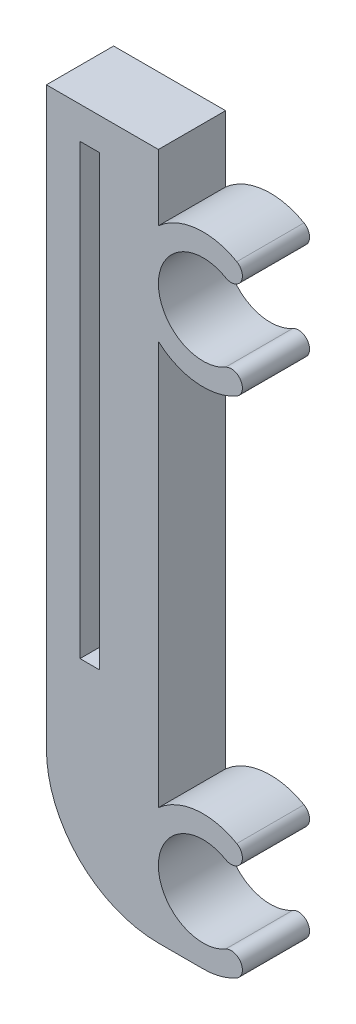
ISO-10303-21;
HEADER;
FILE_DESCRIPTION(('STEP AP214'),'2;1');
FILE_NAME('part.step','',(''),(''),'','','');
FILE_SCHEMA(('AUTOMOTIVE_DESIGN { 1 0 10303 214 1 1 1 1 }'));
ENDSEC;
DATA;
#1=APPLICATION_CONTEXT('core data for automotive mechanical design processes');
#2=APPLICATION_PROTOCOL_DEFINITION('international standard','automotive_design',2000,#1);
#3=PRODUCT_CONTEXT('',#1,'mechanical');
#4=PRODUCT('Part','Part','',(#3));
#5=PRODUCT_RELATED_PRODUCT_CATEGORY('part','',(#4));
#6=PRODUCT_DEFINITION_FORMATION('','',#4);
#7=PRODUCT_DEFINITION_CONTEXT('part definition',#1,'design');
#8=PRODUCT_DEFINITION('design','',#6,#7);
#9=PRODUCT_DEFINITION_SHAPE('','',#8);
#10=(LENGTH_UNIT() NAMED_UNIT(*) SI_UNIT(.MILLI.,.METRE.));
#11=(NAMED_UNIT(*) PLANE_ANGLE_UNIT() SI_UNIT($,.RADIAN.));
#12=(NAMED_UNIT(*) SI_UNIT($,.STERADIAN.) SOLID_ANGLE_UNIT());
#13=UNCERTAINTY_MEASURE_WITH_UNIT(LENGTH_MEASURE(1.E-05),#10,'distance_accuracy_value','');
#14=(GEOMETRIC_REPRESENTATION_CONTEXT(3) GLOBAL_UNCERTAINTY_ASSIGNED_CONTEXT((#13)) GLOBAL_UNIT_ASSIGNED_CONTEXT((#10,
#11,#12)) REPRESENTATION_CONTEXT('',''));
#15=CARTESIAN_POINT('',(0.,0.,0.));
#16=DIRECTION('',(0.,0.,1.));
#17=DIRECTION('',(1.,0.,0.));
#18=AXIS2_PLACEMENT_3D('',#15,#16,#17);
#19=CARTESIAN_POINT('',(10.0729881342838,61.375,6.));
#20=DIRECTION('',(-1.,0.,0.));
#21=DIRECTION('',(0.,0.,1.));
#22=AXIS2_PLACEMENT_3D('',#19,#20,#21);
#23=PLANE('',#22);
#24=DIRECTION('',(0.,1.,0.));
#25=VECTOR('',#24,1.);
#26=CARTESIAN_POINT('',(10.0729881342838,61.375,0.));
#27=LINE('',#26,#25);
#28=CARTESIAN_POINT('',(10.0729881342839,55.4721359549992,0.));
#29=VERTEX_POINT('',#28);
#30=CARTESIAN_POINT('',(10.0729881342838,61.375,0.));
#31=VERTEX_POINT('',#30);
#32=EDGE_CURVE('E189',#29,#31,#27,.T.);
#33=ORIENTED_EDGE('',*,*,#32,.T.);
#34=DIRECTION('',(0.,0.,-1.));
#35=VECTOR('',#34,1.);
#36=CARTESIAN_POINT('',(10.0729881342838,61.375,6.));
#37=LINE('',#36,#35);
#38=CARTESIAN_POINT('',(10.0729881342838,61.375,6.));
#39=VERTEX_POINT('',#38);
#40=EDGE_CURVE('E11',#39,#31,#37,.T.);
#41=ORIENTED_EDGE('',*,*,#40,.F.);
#42=DIRECTION('',(0.,1.,0.));
#43=VECTOR('',#42,1.);
#44=CARTESIAN_POINT('',(10.0729881342838,61.375,6.));
#45=LINE('',#44,#43);
#46=CARTESIAN_POINT('',(10.0729881342839,55.4721359549992,6.));
#47=VERTEX_POINT('',#46);
#48=EDGE_CURVE('E221',#47,#39,#45,.T.);
#49=ORIENTED_EDGE('',*,*,#48,.F.);
#50=DIRECTION('',(0.,0.,-1.));
#51=VECTOR('',#50,1.);
#52=CARTESIAN_POINT('',(10.0729881342839,55.4721359549992,6.));
#53=LINE('',#52,#51);
#54=EDGE_CURVE('E185',#47,#29,#53,.T.);
#55=ORIENTED_EDGE('',*,*,#54,.T.);
#56=EDGE_LOOP('',(#33,#41,#49,#55));
#57=FACE_BOUND('',#56,.T.);
#58=ADVANCED_FACE('F33',(#57),#23,.F.);
#59=CARTESIAN_POINT('',(10.0729881342838,61.375,6.));
#60=DIRECTION('',(0.,-1.,0.));
#61=DIRECTION('',(0.,0.,-1.));
#62=AXIS2_PLACEMENT_3D('',#59,#60,#61);
#63=PLANE('',#62);
#64=DIRECTION('',(-1.,0.,0.));
#65=VECTOR('',#64,1.);
#66=CARTESIAN_POINT('',(10.0729881342838,61.375,0.));
#67=LINE('',#66,#65);
#68=CARTESIAN_POINT('',(0.0729881342837781,61.375,0.));
#69=VERTEX_POINT('',#68);
#70=EDGE_CURVE('E192',#31,#69,#67,.T.);
#71=ORIENTED_EDGE('',*,*,#70,.T.);
#72=DIRECTION('',(0.,0.,-1.));
#73=VECTOR('',#72,1.);
#74=CARTESIAN_POINT('',(0.0729881342837781,61.375,6.));
#75=LINE('',#74,#73);
#76=CARTESIAN_POINT('',(0.0729881342837781,61.375,6.));
#77=VERTEX_POINT('',#76);
#78=EDGE_CURVE('E40',#77,#69,#75,.T.);
#79=ORIENTED_EDGE('',*,*,#78,.F.);
#80=DIRECTION('',(-1.,0.,0.));
#81=VECTOR('',#80,1.);
#82=CARTESIAN_POINT('',(10.0729881342838,61.375,6.));
#83=LINE('',#82,#81);
#84=EDGE_CURVE('E121',#39,#77,#83,.T.);
#85=ORIENTED_EDGE('',*,*,#84,.F.);
#86=ORIENTED_EDGE('',*,*,#40,.T.);
#87=EDGE_LOOP('',(#71,#79,#85,#86));
#88=FACE_BOUND('',#87,.T.);
#89=ADVANCED_FACE('F382',(#88),#63,.F.);
#90=CARTESIAN_POINT('',(0.0729881342837781,61.375,6.));
#91=DIRECTION('',(1.,0.,0.));
#92=DIRECTION('',(0.,1.,0.));
#93=AXIS2_PLACEMENT_3D('',#90,#91,#92);
#94=PLANE('',#93);
#95=DIRECTION('',(0.,-1.,0.));
#96=VECTOR('',#95,1.);
#97=CARTESIAN_POINT('',(0.0729881342837781,61.375,0.));
#98=LINE('',#97,#96);
#99=CARTESIAN_POINT('',(0.0729881342837844,10.0000000000003,0.));
#100=VERTEX_POINT('',#99);
#101=EDGE_CURVE('E195',#69,#100,#98,.T.);
#102=ORIENTED_EDGE('',*,*,#101,.T.);
#103=DIRECTION('',(0.,0.,-1.));
#104=VECTOR('',#103,1.);
#105=CARTESIAN_POINT('',(0.0729881342837844,10.0000000000003,6.));
#106=LINE('',#105,#104);
#107=CARTESIAN_POINT('',(0.0729881342837844,10.0000000000003,6.));
#108=VERTEX_POINT('',#107);
#109=EDGE_CURVE('E252',#108,#100,#106,.T.);
#110=ORIENTED_EDGE('',*,*,#109,.F.);
#111=DIRECTION('',(0.,-1.,0.));
#112=VECTOR('',#111,1.);
#113=CARTESIAN_POINT('',(0.0729881342837781,61.375,6.));
#114=LINE('',#113,#112);
#115=EDGE_CURVE('E260',#77,#108,#114,.T.);
#116=ORIENTED_EDGE('',*,*,#115,.F.);
#117=ORIENTED_EDGE('',*,*,#78,.T.);
#118=EDGE_LOOP('',(#102,#110,#116,#117));
#119=FACE_BOUND('',#118,.T.);
#120=ADVANCED_FACE('F258',(#119),#94,.F.);
#121=CARTESIAN_POINT('',(10.0729881342841,10.0000000000003,6.));
#122=DIRECTION('',(0.,0.,-1.));
#123=DIRECTION('',(-1.,0.,0.));
#124=AXIS2_PLACEMENT_3D('',#121,#122,#123);
#125=CYLINDRICAL_SURFACE('',#124,10.0000000000003);
#126=CARTESIAN_POINT('',(10.0729881342841,10.0000000000003,0.));
#127=DIRECTION('',(0.,0.,1.));
#128=DIRECTION('',(-1.,0.,0.));
#129=AXIS2_PLACEMENT_3D('',#126,#127,#128);
#130=CIRCLE('',#129,10.0000000000003);
#131=CARTESIAN_POINT('',(10.0729881342841,0.,0.));
#132=VERTEX_POINT('',#131);
#133=EDGE_CURVE('E197',#100,#132,#130,.T.);
#134=ORIENTED_EDGE('',*,*,#133,.T.);
#135=DIRECTION('',(0.,0.,-1.));
#136=VECTOR('',#135,1.);
#137=CARTESIAN_POINT('',(10.0729881342841,0.,6.));
#138=LINE('',#137,#136);
#139=CARTESIAN_POINT('',(10.0729881342841,0.,6.));
#140=VERTEX_POINT('',#139);
#141=EDGE_CURVE('E249',#140,#132,#138,.T.);
#142=ORIENTED_EDGE('',*,*,#141,.F.);
#143=CARTESIAN_POINT('',(10.0729881342841,10.0000000000003,6.));
#144=DIRECTION('',(0.,0.,1.));
#145=DIRECTION('',(-1.,0.,0.));
#146=AXIS2_PLACEMENT_3D('',#143,#144,#145);
#147=CIRCLE('',#146,10.0000000000003);
#148=EDGE_CURVE('E278',#108,#140,#147,.T.);
#149=ORIENTED_EDGE('',*,*,#148,.F.);
#150=ORIENTED_EDGE('',*,*,#109,.T.);
#151=EDGE_LOOP('',(#134,#142,#149,#150));
#152=FACE_BOUND('',#151,.T.);
#153=ADVANCED_FACE('F269',(#152),#125,.T.);
#154=CARTESIAN_POINT('',(14.0729881342842,0.,6.));
#155=DIRECTION('',(0.,1.,0.));
#156=DIRECTION('',(-1.,0.,0.));
#157=AXIS2_PLACEMENT_3D('',#154,#155,#156);
#158=PLANE('',#157);
#159=DIRECTION('',(1.,0.,0.));
#160=VECTOR('',#159,1.);
#161=CARTESIAN_POINT('',(14.0729881342842,0.,0.));
#162=LINE('',#161,#160);
#163=CARTESIAN_POINT('',(14.0729881342842,0.,0.));
#164=VERTEX_POINT('',#163);
#165=EDGE_CURVE('E199',#132,#164,#162,.T.);
#166=ORIENTED_EDGE('',*,*,#165,.T.);
#167=DIRECTION('',(0.,0.,-1.));
#168=VECTOR('',#167,1.);
#169=CARTESIAN_POINT('',(14.0729881342842,0.,6.));
#170=LINE('',#169,#168);
#171=CARTESIAN_POINT('',(14.0729881342842,0.,6.));
#172=VERTEX_POINT('',#171);
#173=EDGE_CURVE('E246',#172,#164,#170,.T.);
#174=ORIENTED_EDGE('',*,*,#173,.F.);
#175=DIRECTION('',(1.,0.,0.));
#176=VECTOR('',#175,1.);
#177=CARTESIAN_POINT('',(14.0729881342842,0.,6.));
#178=LINE('',#177,#176);
#179=EDGE_CURVE('E275',#140,#172,#178,.T.);
#180=ORIENTED_EDGE('',*,*,#179,.F.);
#181=ORIENTED_EDGE('',*,*,#141,.T.);
#182=EDGE_LOOP('',(#166,#174,#180,#181));
#183=FACE_BOUND('',#182,.T.);
#184=ADVANCED_FACE('F273',(#183),#158,.F.);
#185=CARTESIAN_POINT('',(14.0729881342842,5.99999999999987,6.));
#186=DIRECTION('',(0.,0.,-1.));
#187=DIRECTION('',(-1.,0.,0.));
#188=AXIS2_PLACEMENT_3D('',#185,#186,#187);
#189=CYLINDRICAL_SURFACE('',#188,5.99999999999987);
#190=CARTESIAN_POINT('',(14.0729881342842,5.99999999999987,0.));
#191=DIRECTION('',(0.,0.,1.));
#192=DIRECTION('',(1.,0.,0.));
#193=AXIS2_PLACEMENT_3D('',#190,#191,#192);
#194=CIRCLE('',#193,5.99999999999987);
#195=CARTESIAN_POINT('',(17.0729881342842,0.803847577293373,0.));
#196=VERTEX_POINT('',#195);
#197=EDGE_CURVE('E201',#164,#196,#194,.T.);
#198=ORIENTED_EDGE('',*,*,#197,.T.);
#199=DIRECTION('',(0.,0.,-1.));
#200=VECTOR('',#199,1.);
#201=CARTESIAN_POINT('',(17.0729881342842,0.803847577293373,6.));
#202=LINE('',#201,#200);
#203=CARTESIAN_POINT('',(17.0729881342842,0.803847577293373,6.));
#204=VERTEX_POINT('',#203);
#205=EDGE_CURVE('E243',#204,#196,#202,.T.);
#206=ORIENTED_EDGE('',*,*,#205,.F.);
#207=CARTESIAN_POINT('',(14.0729881342842,5.99999999999987,6.));
#208=DIRECTION('',(0.,0.,1.));
#209=DIRECTION('',(1.,0.,0.));
#210=AXIS2_PLACEMENT_3D('',#207,#208,#209);
#211=CIRCLE('',#210,5.99999999999987);
#212=EDGE_CURVE('E277',#172,#204,#211,.T.);
#213=ORIENTED_EDGE('',*,*,#212,.F.);
#214=ORIENTED_EDGE('',*,*,#173,.T.);
#215=EDGE_LOOP('',(#198,#206,#213,#214));
#216=FACE_BOUND('',#215,.T.);
#217=ADVANCED_FACE('F395',(#216),#189,.T.);
#218=CARTESIAN_POINT('',(16.5729881342842,1.6698729810777,6.));
#219=DIRECTION('',(0.,0.,-1.));
#220=DIRECTION('',(-1.,0.,0.));
#221=AXIS2_PLACEMENT_3D('',#218,#219,#220);
#222=CYLINDRICAL_SURFACE('',#221,0.999999999999879);
#223=CARTESIAN_POINT('',(16.5729881342842,1.6698729810777,0.));
#224=DIRECTION('',(0.,0.,1.));
#225=DIRECTION('',(1.,0.,0.));
#226=AXIS2_PLACEMENT_3D('',#223,#224,#225);
#227=CIRCLE('',#226,0.999999999999879);
#228=CARTESIAN_POINT('',(16.0729881342843,2.53589838486206,0.));
#229=VERTEX_POINT('',#228);
#230=EDGE_CURVE('E203',#196,#229,#227,.T.);
#231=ORIENTED_EDGE('',*,*,#230,.T.);
#232=DIRECTION('',(0.,0.,-1.));
#233=VECTOR('',#232,1.);
#234=CARTESIAN_POINT('',(16.0729881342843,2.53589838486206,6.));
#235=LINE('',#234,#233);
#236=CARTESIAN_POINT('',(16.0729881342843,2.53589838486206,6.));
#237=VERTEX_POINT('',#236);
#238=EDGE_CURVE('E240',#237,#229,#235,.T.);
#239=ORIENTED_EDGE('',*,*,#238,.F.);
#240=CARTESIAN_POINT('',(16.5729881342842,1.6698729810777,6.));
#241=DIRECTION('',(0.,0.,1.));
#242=DIRECTION('',(1.,0.,0.));
#243=AXIS2_PLACEMENT_3D('',#240,#241,#242);
#244=CIRCLE('',#243,0.999999999999879);
#245=EDGE_CURVE('E280',#204,#237,#244,.T.);
#246=ORIENTED_EDGE('',*,*,#245,.F.);
#247=ORIENTED_EDGE('',*,*,#205,.T.);
#248=EDGE_LOOP('',(#231,#239,#246,#247));
#249=FACE_BOUND('',#248,.T.);
#250=ADVANCED_FACE('F398',(#249),#222,.T.);
#251=CARTESIAN_POINT('',(14.0729881342842,5.99999999999987,6.));
#252=DIRECTION('',(0.,0.,-1.));
#253=DIRECTION('',(-1.,0.,0.));
#254=AXIS2_PLACEMENT_3D('',#251,#252,#253);
#255=CYLINDRICAL_SURFACE('',#254,4.00000000000011);
#256=CARTESIAN_POINT('',(14.0729881342842,5.99999999999987,0.));
#257=DIRECTION('',(0.,0.,-1.));
#258=DIRECTION('',(1.,0.,0.));
#259=AXIS2_PLACEMENT_3D('',#256,#257,#258);
#260=CIRCLE('',#259,4.00000000000011);
#261=CARTESIAN_POINT('',(16.0729881342842,9.46410161513774,0.));
#262=VERTEX_POINT('',#261);
#263=EDGE_CURVE('E205',#229,#262,#260,.T.);
#264=ORIENTED_EDGE('',*,*,#263,.T.);
#265=DIRECTION('',(0.,0.,-1.));
#266=VECTOR('',#265,1.);
#267=CARTESIAN_POINT('',(16.0729881342842,9.46410161513774,6.));
#268=LINE('',#267,#266);
#269=CARTESIAN_POINT('',(16.0729881342842,9.46410161513774,6.));
#270=VERTEX_POINT('',#269);
#271=EDGE_CURVE('E237',#270,#262,#268,.T.);
#272=ORIENTED_EDGE('',*,*,#271,.F.);
#273=CARTESIAN_POINT('',(14.0729881342842,5.99999999999987,6.));
#274=DIRECTION('',(0.,0.,-1.));
#275=DIRECTION('',(1.,0.,0.));
#276=AXIS2_PLACEMENT_3D('',#273,#274,#275);
#277=CIRCLE('',#276,4.00000000000011);
#278=EDGE_CURVE('E286',#237,#270,#277,.T.);
#279=ORIENTED_EDGE('',*,*,#278,.F.);
#280=ORIENTED_EDGE('',*,*,#238,.T.);
#281=EDGE_LOOP('',(#264,#272,#279,#280));
#282=FACE_BOUND('',#281,.T.);
#283=ADVANCED_FACE('F402',(#282),#255,.F.);
#284=CARTESIAN_POINT('',(16.5729881342841,10.3301270189221,6.));
#285=DIRECTION('',(0.,0.,-1.));
#286=DIRECTION('',(-1.,0.,0.));
#287=AXIS2_PLACEMENT_3D('',#284,#285,#286);
#288=CYLINDRICAL_SURFACE('',#287,0.999999999999879);
#289=CARTESIAN_POINT('',(16.5729881342841,10.3301270189221,0.));
#290=DIRECTION('',(0.,0.,1.));
#291=DIRECTION('',(1.,0.,0.));
#292=AXIS2_PLACEMENT_3D('',#289,#290,#291);
#293=CIRCLE('',#292,0.999999999999879);
#294=CARTESIAN_POINT('',(17.0729881342841,11.1961524227064,0.));
#295=VERTEX_POINT('',#294);
#296=EDGE_CURVE('E207',#262,#295,#293,.T.);
#297=ORIENTED_EDGE('',*,*,#296,.T.);
#298=DIRECTION('',(0.,0.,-1.));
#299=VECTOR('',#298,1.);
#300=CARTESIAN_POINT('',(17.0729881342841,11.1961524227064,6.));
#301=LINE('',#300,#299);
#302=CARTESIAN_POINT('',(17.0729881342841,11.1961524227064,6.));
#303=VERTEX_POINT('',#302);
#304=EDGE_CURVE('E234',#303,#295,#301,.T.);
#305=ORIENTED_EDGE('',*,*,#304,.F.);
#306=CARTESIAN_POINT('',(16.5729881342841,10.3301270189221,6.));
#307=DIRECTION('',(0.,0.,1.));
#308=DIRECTION('',(1.,0.,0.));
#309=AXIS2_PLACEMENT_3D('',#306,#307,#308);
#310=CIRCLE('',#309,0.999999999999879);
#311=EDGE_CURVE('E288',#270,#303,#310,.T.);
#312=ORIENTED_EDGE('',*,*,#311,.F.);
#313=ORIENTED_EDGE('',*,*,#271,.T.);
#314=EDGE_LOOP('',(#297,#305,#312,#313));
#315=FACE_BOUND('',#314,.T.);
#316=ADVANCED_FACE('F406',(#315),#288,.T.);
#317=CARTESIAN_POINT('',(14.0729881342842,5.99999999999987,6.));
#318=DIRECTION('',(0.,0.,-1.));
#319=DIRECTION('',(-1.,0.,0.));
#320=AXIS2_PLACEMENT_3D('',#317,#318,#319);
#321=CYLINDRICAL_SURFACE('',#320,5.99999999999986);
#322=CARTESIAN_POINT('',(14.0729881342842,5.99999999999987,0.));
#323=DIRECTION('',(0.,0.,1.));
#324=DIRECTION('',(1.,0.,0.));
#325=AXIS2_PLACEMENT_3D('',#322,#323,#324);
#326=CIRCLE('',#325,5.99999999999986);
#327=CARTESIAN_POINT('',(10.0729881342841,10.4721359549992,0.));
#328=VERTEX_POINT('',#327);
#329=EDGE_CURVE('E209',#295,#328,#326,.T.);
#330=ORIENTED_EDGE('',*,*,#329,.T.);
#331=DIRECTION('',(0.,0.,-1.));
#332=VECTOR('',#331,1.);
#333=CARTESIAN_POINT('',(10.0729881342841,10.4721359549992,6.));
#334=LINE('',#333,#332);
#335=CARTESIAN_POINT('',(10.0729881342841,10.4721359549992,6.));
#336=VERTEX_POINT('',#335);
#337=EDGE_CURVE('E231',#336,#328,#334,.T.);
#338=ORIENTED_EDGE('',*,*,#337,.F.);
#339=CARTESIAN_POINT('',(14.0729881342842,5.99999999999987,6.));
#340=DIRECTION('',(0.,0.,1.));
#341=DIRECTION('',(1.,0.,0.));
#342=AXIS2_PLACEMENT_3D('',#339,#340,#341);
#343=CIRCLE('',#342,5.99999999999986);
#344=EDGE_CURVE('E290',#303,#336,#343,.T.);
#345=ORIENTED_EDGE('',*,*,#344,.F.);
#346=ORIENTED_EDGE('',*,*,#304,.T.);
#347=EDGE_LOOP('',(#330,#338,#345,#346));
#348=FACE_BOUND('',#347,.T.);
#349=ADVANCED_FACE('F410',(#348),#321,.T.);
#350=CARTESIAN_POINT('',(10.0729881342841,10.4721359549992,6.));
#351=DIRECTION('',(-1.,0.,0.));
#352=DIRECTION('',(0.,0.,1.));
#353=AXIS2_PLACEMENT_3D('',#350,#351,#352);
#354=PLANE('',#353);
#355=DIRECTION('',(0.,1.,0.));
#356=VECTOR('',#355,1.);
#357=CARTESIAN_POINT('',(10.0729881342841,10.4721359549992,0.));
#358=LINE('',#357,#356);
#359=CARTESIAN_POINT('',(10.0729881342841,46.5278640450004,0.));
#360=VERTEX_POINT('',#359);
#361=EDGE_CURVE('E211',#328,#360,#358,.T.);
#362=ORIENTED_EDGE('',*,*,#361,.T.);
#363=DIRECTION('',(0.,0.,-1.));
#364=VECTOR('',#363,1.);
#365=CARTESIAN_POINT('',(10.0729881342841,46.5278640450004,6.));
#366=LINE('',#365,#364);
#367=CARTESIAN_POINT('',(10.0729881342841,46.5278640450004,6.));
#368=VERTEX_POINT('',#367);
#369=EDGE_CURVE('E228',#368,#360,#366,.T.);
#370=ORIENTED_EDGE('',*,*,#369,.F.);
#371=DIRECTION('',(0.,1.,0.));
#372=VECTOR('',#371,1.);
#373=CARTESIAN_POINT('',(10.0729881342841,10.4721359549992,6.));
#374=LINE('',#373,#372);
#375=EDGE_CURVE('E292',#336,#368,#374,.T.);
#376=ORIENTED_EDGE('',*,*,#375,.F.);
#377=ORIENTED_EDGE('',*,*,#337,.T.);
#378=EDGE_LOOP('',(#362,#370,#376,#377));
#379=FACE_BOUND('',#378,.T.);
#380=ADVANCED_FACE('F414',(#379),#354,.F.);
#381=CARTESIAN_POINT('',(14.0729881342826,51.,6.));
#382=DIRECTION('',(0.,0.,-1.));
#383=DIRECTION('',(-1.,0.,0.));
#384=AXIS2_PLACEMENT_3D('',#381,#382,#383);
#385=CYLINDRICAL_SURFACE('',#384,5.99999999999902);
#386=CARTESIAN_POINT('',(14.0729881342826,51.,0.));
#387=DIRECTION('',(0.,0.,1.));
#388=DIRECTION('',(1.,0.,0.));
#389=AXIS2_PLACEMENT_3D('',#386,#387,#388);
#390=CIRCLE('',#389,5.99999999999902);
#391=CARTESIAN_POINT('',(17.0729881342831,45.8038475772948,0.));
#392=VERTEX_POINT('',#391);
#393=EDGE_CURVE('E213',#360,#392,#390,.T.);
#394=ORIENTED_EDGE('',*,*,#393,.T.);
#395=DIRECTION('',(0.,0.,-1.));
#396=VECTOR('',#395,1.);
#397=CARTESIAN_POINT('',(17.0729881342831,45.8038475772948,6.));
#398=LINE('',#397,#396);
#399=CARTESIAN_POINT('',(17.0729881342831,45.8038475772948,6.));
#400=VERTEX_POINT('',#399);
#401=EDGE_CURVE('E225',#400,#392,#398,.T.);
#402=ORIENTED_EDGE('',*,*,#401,.F.);
#403=CARTESIAN_POINT('',(14.0729881342826,51.,6.));
#404=DIRECTION('',(0.,0.,1.));
#405=DIRECTION('',(1.,0.,0.));
#406=AXIS2_PLACEMENT_3D('',#403,#404,#405);
#407=CIRCLE('',#406,5.99999999999902);
#408=EDGE_CURVE('E294',#368,#400,#407,.T.);
#409=ORIENTED_EDGE('',*,*,#408,.F.);
#410=ORIENTED_EDGE('',*,*,#369,.T.);
#411=EDGE_LOOP('',(#394,#402,#409,#410));
#412=FACE_BOUND('',#411,.T.);
#413=ADVANCED_FACE('F300',(#412),#385,.T.);
#414=CARTESIAN_POINT('',(16.5729881342835,46.6698729810784,6.));
#415=DIRECTION('',(0.,0.,-1.));
#416=DIRECTION('',(-1.,0.,0.));
#417=AXIS2_PLACEMENT_3D('',#414,#415,#416);
#418=CYLINDRICAL_SURFACE('',#417,0.999999999998944);
#419=CARTESIAN_POINT('',(16.5729881342835,46.6698729810784,0.));
#420=DIRECTION('',(0.,0.,1.));
#421=DIRECTION('',(1.,0.,0.));
#422=AXIS2_PLACEMENT_3D('',#419,#420,#421);
#423=CIRCLE('',#422,0.999999999998944);
#424=CARTESIAN_POINT('',(16.072988134284,47.5358983848619,0.));
#425=VERTEX_POINT('',#424);
#426=EDGE_CURVE('E215',#392,#425,#423,.T.);
#427=ORIENTED_EDGE('',*,*,#426,.T.);
#428=DIRECTION('',(0.,0.,-1.));
#429=VECTOR('',#428,1.);
#430=CARTESIAN_POINT('',(16.072988134284,47.5358983848619,6.));
#431=LINE('',#430,#429);
#432=CARTESIAN_POINT('',(16.072988134284,47.5358983848619,6.));
#433=VERTEX_POINT('',#432);
#434=EDGE_CURVE('E180',#433,#425,#431,.T.);
#435=ORIENTED_EDGE('',*,*,#434,.F.);
#436=CARTESIAN_POINT('',(16.5729881342835,46.6698729810784,6.));
#437=DIRECTION('',(0.,0.,1.));
#438=DIRECTION('',(1.,0.,0.));
#439=AXIS2_PLACEMENT_3D('',#436,#437,#438);
#440=CIRCLE('',#439,0.999999999998944);
#441=EDGE_CURVE('E168',#400,#433,#440,.T.);
#442=ORIENTED_EDGE('',*,*,#441,.F.);
#443=ORIENTED_EDGE('',*,*,#401,.T.);
#444=EDGE_LOOP('',(#427,#435,#442,#443));
#445=FACE_BOUND('',#444,.T.);
#446=ADVANCED_FACE('F304',(#445),#418,.T.);
#447=CARTESIAN_POINT('',(14.0729881342826,51.,6.));
#448=DIRECTION('',(0.,0.,-1.));
#449=DIRECTION('',(-1.,0.,0.));
#450=AXIS2_PLACEMENT_3D('',#447,#448,#449);
#451=CYLINDRICAL_SURFACE('',#450,4.00000000000094);
#452=CARTESIAN_POINT('',(14.0729881342826,51.,0.));
#453=DIRECTION('',(0.,0.,-1.));
#454=DIRECTION('',(1.,0.,0.));
#455=AXIS2_PLACEMENT_3D('',#452,#453,#454);
#456=CIRCLE('',#455,4.00000000000094);
#457=CARTESIAN_POINT('',(16.0729881342843,54.4641016151379,0.));
#458=VERTEX_POINT('',#457);
#459=EDGE_CURVE('E177',#425,#458,#456,.T.);
#460=ORIENTED_EDGE('',*,*,#459,.T.);
#461=DIRECTION('',(0.,0.,-1.));
#462=VECTOR('',#461,1.);
#463=CARTESIAN_POINT('',(16.0729881342843,54.4641016151379,6.));
#464=LINE('',#463,#462);
#465=CARTESIAN_POINT('',(16.0729881342843,54.4641016151379,6.));
#466=VERTEX_POINT('',#465);
#467=EDGE_CURVE('E174',#466,#458,#464,.T.);
#468=ORIENTED_EDGE('',*,*,#467,.F.);
#469=CARTESIAN_POINT('',(14.0729881342826,51.,6.));
#470=DIRECTION('',(0.,0.,-1.));
#471=DIRECTION('',(1.,0.,0.));
#472=AXIS2_PLACEMENT_3D('',#469,#470,#471);
#473=CIRCLE('',#472,4.00000000000094);
#474=EDGE_CURVE('E161',#433,#466,#473,.T.);
#475=ORIENTED_EDGE('',*,*,#474,.F.);
#476=ORIENTED_EDGE('',*,*,#434,.T.);
#477=EDGE_LOOP('',(#460,#468,#475,#476));
#478=FACE_BOUND('',#477,.T.);
#479=ADVANCED_FACE('F175',(#478),#451,.F.);
#480=CARTESIAN_POINT('',(16.5729881342838,55.3301270189211,6.));
#481=DIRECTION('',(0.,0.,-1.));
#482=DIRECTION('',(-1.,0.,0.));
#483=AXIS2_PLACEMENT_3D('',#480,#481,#482);
#484=CYLINDRICAL_SURFACE('',#483,0.999999999998991);
#485=CARTESIAN_POINT('',(16.5729881342838,55.3301270189211,0.));
#486=DIRECTION('',(0.,0.,1.));
#487=DIRECTION('',(1.,0.,0.));
#488=AXIS2_PLACEMENT_3D('',#485,#486,#487);
#489=CIRCLE('',#488,0.999999999998991);
#490=CARTESIAN_POINT('',(17.0729881342834,56.1961524227046,0.));
#491=VERTEX_POINT('',#490);
#492=EDGE_CURVE('E218',#458,#491,#489,.T.);
#493=ORIENTED_EDGE('',*,*,#492,.T.);
#494=DIRECTION('',(0.,0.,-1.));
#495=VECTOR('',#494,1.);
#496=CARTESIAN_POINT('',(17.0729881342834,56.1961524227046,6.));
#497=LINE('',#496,#495);
#498=CARTESIAN_POINT('',(17.0729881342834,56.1961524227046,6.));
#499=VERTEX_POINT('',#498);
#500=EDGE_CURVE('E181',#499,#491,#497,.T.);
#501=ORIENTED_EDGE('',*,*,#500,.F.);
#502=CARTESIAN_POINT('',(16.5729881342838,55.3301270189211,6.));
#503=DIRECTION('',(0.,0.,1.));
#504=DIRECTION('',(1.,0.,0.));
#505=AXIS2_PLACEMENT_3D('',#502,#503,#504);
#506=CIRCLE('',#505,0.999999999998991);
#507=EDGE_CURVE('E165',#466,#499,#506,.T.);
#508=ORIENTED_EDGE('',*,*,#507,.F.);
#509=ORIENTED_EDGE('',*,*,#467,.T.);
#510=EDGE_LOOP('',(#493,#501,#508,#509));
#511=FACE_BOUND('',#510,.T.);
#512=ADVANCED_FACE('F183',(#511),#484,.T.);
#513=CARTESIAN_POINT('',(14.0729881342826,51.,6.));
#514=DIRECTION('',(0.,0.,-1.));
#515=DIRECTION('',(-1.,0.,0.));
#516=AXIS2_PLACEMENT_3D('',#513,#514,#515);
#517=CYLINDRICAL_SURFACE('',#516,5.99999999999887);
#518=CARTESIAN_POINT('',(14.0729881342826,51.,0.));
#519=DIRECTION('',(0.,0.,1.));
#520=DIRECTION('',(1.,0.,0.));
#521=AXIS2_PLACEMENT_3D('',#518,#519,#520);
#522=CIRCLE('',#521,5.99999999999887);
#523=EDGE_CURVE('E113',#491,#29,#522,.T.);
#524=ORIENTED_EDGE('',*,*,#523,.T.);
#525=ORIENTED_EDGE('',*,*,#54,.F.);
#526=CARTESIAN_POINT('',(14.0729881342826,51.,6.));
#527=DIRECTION('',(0.,0.,1.));
#528=DIRECTION('',(1.,0.,0.));
#529=AXIS2_PLACEMENT_3D('',#526,#527,#528);
#530=CIRCLE('',#529,5.99999999999887);
#531=EDGE_CURVE('E56',#499,#47,#530,.T.);
#532=ORIENTED_EDGE('',*,*,#531,.F.);
#533=ORIENTED_EDGE('',*,*,#500,.T.);
#534=EDGE_LOOP('',(#524,#525,#532,#533));
#535=FACE_BOUND('',#534,.T.);
#536=ADVANCED_FACE('F305',(#535),#517,.T.);
#537=CARTESIAN_POINT('',(14.0729881342826,51.,6.));
#538=DIRECTION('',(0.,0.,1.));
#539=DIRECTION('',(1.,0.,0.));
#540=AXIS2_PLACEMENT_3D('',#537,#538,#539);
#541=PLANE('',#540);
#542=DIRECTION('',(0.,-1.,0.));
#543=VECTOR('',#542,1.);
#544=CARTESIAN_POINT('',(3.07298813428378,58.5,6.));
#545=LINE('',#544,#543);
#546=CARTESIAN_POINT('',(3.07298813428378,58.5,6.));
#547=VERTEX_POINT('',#546);
#548=CARTESIAN_POINT('',(3.07298813428378,18.5,6.));
#549=VERTEX_POINT('',#548);
#550=EDGE_CURVE('E47',#547,#549,#545,.T.);
#551=ORIENTED_EDGE('',*,*,#550,.F.);
#552=DIRECTION('',(-1.,0.,0.));
#553=VECTOR('',#552,1.);
#554=CARTESIAN_POINT('',(3.07298813428378,58.5,6.));
#555=LINE('',#554,#553);
#556=CARTESIAN_POINT('',(4.82298813428378,58.5,6.));
#557=VERTEX_POINT('',#556);
#558=EDGE_CURVE('E322',#557,#547,#555,.T.);
#559=ORIENTED_EDGE('',*,*,#558,.F.);
#560=DIRECTION('',(0.,1.,0.));
#561=VECTOR('',#560,1.);
#562=CARTESIAN_POINT('',(4.82298813428378,58.5,6.));
#563=LINE('',#562,#561);
#564=CARTESIAN_POINT('',(4.82298813428378,18.5,6.));
#565=VERTEX_POINT('',#564);
#566=EDGE_CURVE('E326',#565,#557,#563,.T.);
#567=ORIENTED_EDGE('',*,*,#566,.F.);
#568=DIRECTION('',(1.,0.,0.));
#569=VECTOR('',#568,1.);
#570=CARTESIAN_POINT('',(3.07298813428378,18.5,6.));
#571=LINE('',#570,#569);
#572=EDGE_CURVE('E329',#549,#565,#571,.T.);
#573=ORIENTED_EDGE('',*,*,#572,.F.);
#574=EDGE_LOOP('',(#551,#559,#567,#573));
#575=FACE_BOUND('',#574,.T.);
#576=ORIENTED_EDGE('',*,*,#48,.T.);
#577=ORIENTED_EDGE('',*,*,#84,.T.);
#578=ORIENTED_EDGE('',*,*,#115,.T.);
#579=ORIENTED_EDGE('',*,*,#148,.T.);
#580=ORIENTED_EDGE('',*,*,#179,.T.);
#581=ORIENTED_EDGE('',*,*,#212,.T.);
#582=ORIENTED_EDGE('',*,*,#245,.T.);
#583=ORIENTED_EDGE('',*,*,#278,.T.);
#584=ORIENTED_EDGE('',*,*,#311,.T.);
#585=ORIENTED_EDGE('',*,*,#344,.T.);
#586=ORIENTED_EDGE('',*,*,#375,.T.);
#587=ORIENTED_EDGE('',*,*,#408,.T.);
#588=ORIENTED_EDGE('',*,*,#441,.T.);
#589=ORIENTED_EDGE('',*,*,#474,.T.);
#590=ORIENTED_EDGE('',*,*,#507,.T.);
#591=ORIENTED_EDGE('',*,*,#531,.T.);
#592=EDGE_LOOP('',(#576,#577,#578,#579,#580,#581,#582,#583,#584,#585,#586,#587,#588,#589,#590,#591));
#593=FACE_BOUND('',#592,.T.);
#594=ADVANCED_FACE('F163',(#575,#593),#541,.T.);
#595=CARTESIAN_POINT('',(14.0729881342826,51.,0.));
#596=DIRECTION('',(0.,0.,1.));
#597=DIRECTION('',(1.,0.,0.));
#598=AXIS2_PLACEMENT_3D('',#595,#596,#597);
#599=PLANE('',#598);
#600=ORIENTED_EDGE('',*,*,#32,.F.);
#601=ORIENTED_EDGE('',*,*,#523,.F.);
#602=ORIENTED_EDGE('',*,*,#492,.F.);
#603=ORIENTED_EDGE('',*,*,#459,.F.);
#604=ORIENTED_EDGE('',*,*,#426,.F.);
#605=ORIENTED_EDGE('',*,*,#393,.F.);
#606=ORIENTED_EDGE('',*,*,#361,.F.);
#607=ORIENTED_EDGE('',*,*,#329,.F.);
#608=ORIENTED_EDGE('',*,*,#296,.F.);
#609=ORIENTED_EDGE('',*,*,#263,.F.);
#610=ORIENTED_EDGE('',*,*,#230,.F.);
#611=ORIENTED_EDGE('',*,*,#197,.F.);
#612=ORIENTED_EDGE('',*,*,#165,.F.);
#613=ORIENTED_EDGE('',*,*,#133,.F.);
#614=ORIENTED_EDGE('',*,*,#101,.F.);
#615=ORIENTED_EDGE('',*,*,#70,.F.);
#616=EDGE_LOOP('',(#600,#601,#602,#603,#604,#605,#606,#607,#608,#609,#610,#611,#612,#613,#614,#615));
#617=FACE_BOUND('',#616,.T.);
#618=ADVANCED_FACE('F264',(#617),#599,.F.);
#619=CARTESIAN_POINT('',(3.07298813428378,58.5,1.5));
#620=DIRECTION('',(-1.,0.,0.));
#621=DIRECTION('',(0.,-1.,0.));
#622=AXIS2_PLACEMENT_3D('',#619,#620,#621);
#623=PLANE('',#622);
#624=ORIENTED_EDGE('',*,*,#550,.T.);
#625=DIRECTION('',(0.,0.,1.));
#626=VECTOR('',#625,1.);
#627=CARTESIAN_POINT('',(3.07298813428378,18.5,1.5));
#628=LINE('',#627,#626);
#629=CARTESIAN_POINT('',(3.07298813428378,18.5,1.5));
#630=VERTEX_POINT('',#629);
#631=EDGE_CURVE('E312',#630,#549,#628,.T.);
#632=ORIENTED_EDGE('',*,*,#631,.F.);
#633=DIRECTION('',(0.,-1.,0.));
#634=VECTOR('',#633,1.);
#635=CARTESIAN_POINT('',(3.07298813428378,58.5,1.5));
#636=LINE('',#635,#634);
#637=CARTESIAN_POINT('',(3.07298813428378,58.5,1.5));
#638=VERTEX_POINT('',#637);
#639=EDGE_CURVE('E325',#638,#630,#636,.T.);
#640=ORIENTED_EDGE('',*,*,#639,.F.);
#641=DIRECTION('',(0.,0.,1.));
#642=VECTOR('',#641,1.);
#643=CARTESIAN_POINT('',(3.07298813428378,58.5,1.5));
#644=LINE('',#643,#642);
#645=EDGE_CURVE('E193',#638,#547,#644,.T.);
#646=ORIENTED_EDGE('',*,*,#645,.T.);
#647=EDGE_LOOP('',(#624,#632,#640,#646));
#648=FACE_BOUND('',#647,.T.);
#649=ADVANCED_FACE('F350',(#648),#623,.F.);
#650=CARTESIAN_POINT('',(3.07298813428378,58.5,1.5));
#651=DIRECTION('',(0.,1.,0.));
#652=DIRECTION('',(0.,0.,1.));
#653=AXIS2_PLACEMENT_3D('',#650,#651,#652);
#654=PLANE('',#653);
#655=ORIENTED_EDGE('',*,*,#558,.T.);
#656=ORIENTED_EDGE('',*,*,#645,.F.);
#657=DIRECTION('',(-1.,0.,0.));
#658=VECTOR('',#657,1.);
#659=CARTESIAN_POINT('',(3.07298813428378,58.5,1.5));
#660=LINE('',#659,#658);
#661=CARTESIAN_POINT('',(4.82298813428378,58.5,1.5));
#662=VERTEX_POINT('',#661);
#663=EDGE_CURVE('E315',#662,#638,#660,.T.);
#664=ORIENTED_EDGE('',*,*,#663,.F.);
#665=DIRECTION('',(0.,0.,1.));
#666=VECTOR('',#665,1.);
#667=CARTESIAN_POINT('',(4.82298813428378,58.5,1.5));
#668=LINE('',#667,#666);
#669=EDGE_CURVE('E318',#662,#557,#668,.T.);
#670=ORIENTED_EDGE('',*,*,#669,.T.);
#671=EDGE_LOOP('',(#655,#656,#664,#670));
#672=FACE_BOUND('',#671,.T.);
#673=ADVANCED_FACE('F361',(#672),#654,.F.);
#674=CARTESIAN_POINT('',(4.82298813428378,58.5,1.5));
#675=DIRECTION('',(1.,0.,0.));
#676=DIRECTION('',(0.,1.,0.));
#677=AXIS2_PLACEMENT_3D('',#674,#675,#676);
#678=PLANE('',#677);
#679=ORIENTED_EDGE('',*,*,#566,.T.);
#680=ORIENTED_EDGE('',*,*,#669,.F.);
#681=DIRECTION('',(0.,1.,0.));
#682=VECTOR('',#681,1.);
#683=CARTESIAN_POINT('',(4.82298813428378,58.5,1.5));
#684=LINE('',#683,#682);
#685=CARTESIAN_POINT('',(4.82298813428378,18.5,1.5));
#686=VERTEX_POINT('',#685);
#687=EDGE_CURVE('E335',#686,#662,#684,.T.);
#688=ORIENTED_EDGE('',*,*,#687,.F.);
#689=DIRECTION('',(0.,0.,1.));
#690=VECTOR('',#689,1.);
#691=CARTESIAN_POINT('',(4.82298813428378,18.5,1.5));
#692=LINE('',#691,#690);
#693=EDGE_CURVE('E314',#686,#565,#692,.T.);
#694=ORIENTED_EDGE('',*,*,#693,.T.);
#695=EDGE_LOOP('',(#679,#680,#688,#694));
#696=FACE_BOUND('',#695,.T.);
#697=ADVANCED_FACE('F366',(#696),#678,.F.);
#698=CARTESIAN_POINT('',(3.07298813428378,18.5,1.5));
#699=DIRECTION('',(0.,-1.,0.));
#700=DIRECTION('',(0.,0.,-1.));
#701=AXIS2_PLACEMENT_3D('',#698,#699,#700);
#702=PLANE('',#701);
#703=ORIENTED_EDGE('',*,*,#572,.T.);
#704=ORIENTED_EDGE('',*,*,#693,.F.);
#705=DIRECTION('',(1.,0.,0.));
#706=VECTOR('',#705,1.);
#707=CARTESIAN_POINT('',(3.07298813428378,18.5,1.5));
#708=LINE('',#707,#706);
#709=EDGE_CURVE('E338',#630,#686,#708,.T.);
#710=ORIENTED_EDGE('',*,*,#709,.F.);
#711=ORIENTED_EDGE('',*,*,#631,.T.);
#712=EDGE_LOOP('',(#703,#704,#710,#711));
#713=FACE_BOUND('',#712,.T.);
#714=ADVANCED_FACE('F371',(#713),#702,.F.);
#715=CARTESIAN_POINT('',(0.,0.,1.5));
#716=DIRECTION('',(0.,0.,1.));
#717=DIRECTION('',(1.,0.,0.));
#718=AXIS2_PLACEMENT_3D('',#715,#716,#717);
#719=PLANE('',#718);
#720=ORIENTED_EDGE('',*,*,#639,.T.);
#721=ORIENTED_EDGE('',*,*,#709,.T.);
#722=ORIENTED_EDGE('',*,*,#687,.T.);
#723=ORIENTED_EDGE('',*,*,#663,.T.);
#724=EDGE_LOOP('',(#720,#721,#722,#723));
#725=FACE_BOUND('',#724,.T.);
#726=ADVANCED_FACE('F345',(#725),#719,.T.);
#727=CLOSED_SHELL('',(#58,#89,#120,#153,#184,#217,#250,#283,#316,#349,#380,#413,#446,#479,#512,
#536,#594,#618,#649,#673,#697,#714,#726));
#728=MANIFOLD_SOLID_BREP('B2',#727);
#729=ADVANCED_BREP_SHAPE_REPRESENTATION('',(#18,#728),#14);
#730=SHAPE_DEFINITION_REPRESENTATION(#9,#729);
ENDSEC;
END-ISO-10303-21;
